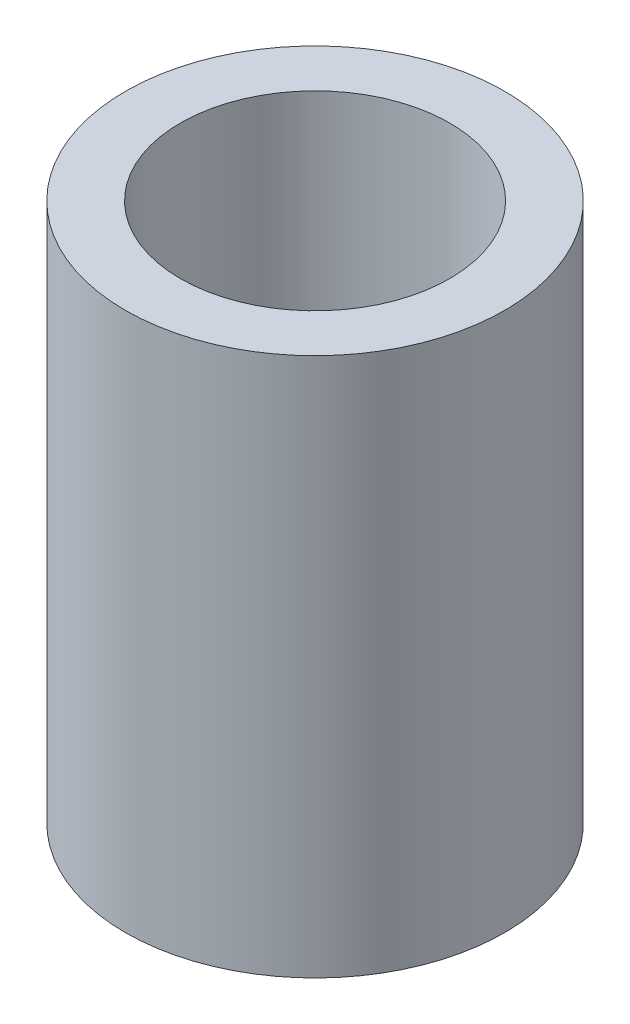
ISO-10303-21;
HEADER;
FILE_DESCRIPTION(('STEP AP214'),'2;1');
FILE_NAME('part.step','',(''),(''),'','','');
FILE_SCHEMA(('AUTOMOTIVE_DESIGN { 1 0 10303 214 1 1 1 1 }'));
ENDSEC;
DATA;
#1=APPLICATION_CONTEXT('core data for automotive mechanical design processes');
#2=APPLICATION_PROTOCOL_DEFINITION('international standard','automotive_design',2000,#1);
#3=PRODUCT_CONTEXT('',#1,'mechanical');
#4=PRODUCT('Part','Part','',(#3));
#5=PRODUCT_RELATED_PRODUCT_CATEGORY('part','',(#4));
#6=PRODUCT_DEFINITION_FORMATION('','',#4);
#7=PRODUCT_DEFINITION_CONTEXT('part definition',#1,'design');
#8=PRODUCT_DEFINITION('design','',#6,#7);
#9=PRODUCT_DEFINITION_SHAPE('','',#8);
#10=(LENGTH_UNIT() NAMED_UNIT(*) SI_UNIT(.MILLI.,.METRE.));
#11=(NAMED_UNIT(*) PLANE_ANGLE_UNIT() SI_UNIT($,.RADIAN.));
#12=(NAMED_UNIT(*) SI_UNIT($,.STERADIAN.) SOLID_ANGLE_UNIT());
#13=UNCERTAINTY_MEASURE_WITH_UNIT(LENGTH_MEASURE(1.E-05),#10,'distance_accuracy_value','');
#14=(GEOMETRIC_REPRESENTATION_CONTEXT(3) GLOBAL_UNCERTAINTY_ASSIGNED_CONTEXT((#13)) GLOBAL_UNIT_ASSIGNED_CONTEXT((#10,
#11,#12)) REPRESENTATION_CONTEXT('',''));
#15=CARTESIAN_POINT('',(0.,0.,0.));
#16=DIRECTION('',(0.,0.,1.));
#17=DIRECTION('',(1.,0.,0.));
#18=AXIS2_PLACEMENT_3D('',#15,#16,#17);
#19=CARTESIAN_POINT('',(0.,15.875,0.));
#20=DIRECTION('',(0.,1.,0.));
#21=DIRECTION('',(0.,0.,1.));
#22=AXIS2_PLACEMENT_3D('',#19,#20,#21);
#23=PLANE('',#22);
#24=CARTESIAN_POINT('',(0.,15.875,0.));
#25=DIRECTION('',(0.,1.,0.));
#26=DIRECTION('',(0.,0.,1.));
#27=AXIS2_PLACEMENT_3D('',#24,#25,#26);
#28=CIRCLE('',#27,5.588);
#29=CARTESIAN_POINT('',(0.,15.875,5.588));
#30=VERTEX_POINT('',#29);
#31=EDGE_CURVE('E10',#30,#30,#28,.T.);
#32=ORIENTED_EDGE('',*,*,#31,.T.);
#33=EDGE_LOOP('',(#32));
#34=FACE_BOUND('',#33,.T.);
#35=CARTESIAN_POINT('',(0.,15.875,0.));
#36=DIRECTION('',(0.,1.,0.));
#37=DIRECTION('',(0.,0.,1.));
#38=AXIS2_PLACEMENT_3D('',#35,#36,#37);
#39=CIRCLE('',#38,3.96875);
#40=CARTESIAN_POINT('',(0.,15.875,3.96875));
#41=VERTEX_POINT('',#40);
#42=EDGE_CURVE('E41',#41,#41,#39,.T.);
#43=ORIENTED_EDGE('',*,*,#42,.F.);
#44=EDGE_LOOP('',(#43));
#45=FACE_BOUND('',#44,.T.);
#46=ADVANCED_FACE('F30',(#34,#45),#23,.T.);
#47=CARTESIAN_POINT('',(0.,0.,0.));
#48=DIRECTION('',(0.,1.,0.));
#49=DIRECTION('',(0.,0.,1.));
#50=AXIS2_PLACEMENT_3D('',#47,#48,#49);
#51=PLANE('',#50);
#52=CARTESIAN_POINT('',(0.,0.,0.));
#53=DIRECTION('',(0.,1.,0.));
#54=DIRECTION('',(0.,0.,1.));
#55=AXIS2_PLACEMENT_3D('',#52,#53,#54);
#56=CIRCLE('',#55,5.588);
#57=CARTESIAN_POINT('',(0.,0.,5.588));
#58=VERTEX_POINT('',#57);
#59=EDGE_CURVE('E34',#58,#58,#56,.T.);
#60=ORIENTED_EDGE('',*,*,#59,.F.);
#61=EDGE_LOOP('',(#60));
#62=FACE_BOUND('',#61,.T.);
#63=CARTESIAN_POINT('',(0.,0.,0.));
#64=DIRECTION('',(0.,1.,0.));
#65=DIRECTION('',(0.,0.,1.));
#66=AXIS2_PLACEMENT_3D('',#63,#64,#65);
#67=CIRCLE('',#66,3.96875);
#68=CARTESIAN_POINT('',(0.,0.,3.96875));
#69=VERTEX_POINT('',#68);
#70=EDGE_CURVE('E43',#69,#69,#67,.T.);
#71=ORIENTED_EDGE('',*,*,#70,.T.);
#72=EDGE_LOOP('',(#71));
#73=FACE_BOUND('',#72,.T.);
#74=ADVANCED_FACE('F53',(#62,#73),#51,.F.);
#75=CARTESIAN_POINT('',(0.,15.875,0.));
#76=DIRECTION('',(0.,-1.,0.));
#77=DIRECTION('',(0.,0.,-1.));
#78=AXIS2_PLACEMENT_3D('',#75,#76,#77);
#79=CYLINDRICAL_SURFACE('',#78,5.588);
#80=ORIENTED_EDGE('',*,*,#31,.F.);
#81=EDGE_LOOP('',(#80));
#82=FACE_BOUND('',#81,.T.);
#83=ORIENTED_EDGE('',*,*,#59,.T.);
#84=EDGE_LOOP('',(#83));
#85=FACE_BOUND('',#84,.T.);
#86=ADVANCED_FACE('F32',(#82,#85),#79,.T.);
#87=CARTESIAN_POINT('',(0.,15.875,0.));
#88=DIRECTION('',(0.,-1.,0.));
#89=DIRECTION('',(0.,0.,-1.));
#90=AXIS2_PLACEMENT_3D('',#87,#88,#89);
#91=CYLINDRICAL_SURFACE('',#90,3.96875);
#92=ORIENTED_EDGE('',*,*,#42,.T.);
#93=EDGE_LOOP('',(#92));
#94=FACE_BOUND('',#93,.T.);
#95=ORIENTED_EDGE('',*,*,#70,.F.);
#96=EDGE_LOOP('',(#95));
#97=FACE_BOUND('',#96,.T.);
#98=ADVANCED_FACE('F49',(#94,#97),#91,.F.);
#99=CLOSED_SHELL('',(#46,#74,#86,#98));
#100=MANIFOLD_SOLID_BREP('B2',#99);
#101=ADVANCED_BREP_SHAPE_REPRESENTATION('',(#18,#100),#14);
#102=SHAPE_DEFINITION_REPRESENTATION(#9,#101);
ENDSEC;
END-ISO-10303-21;
